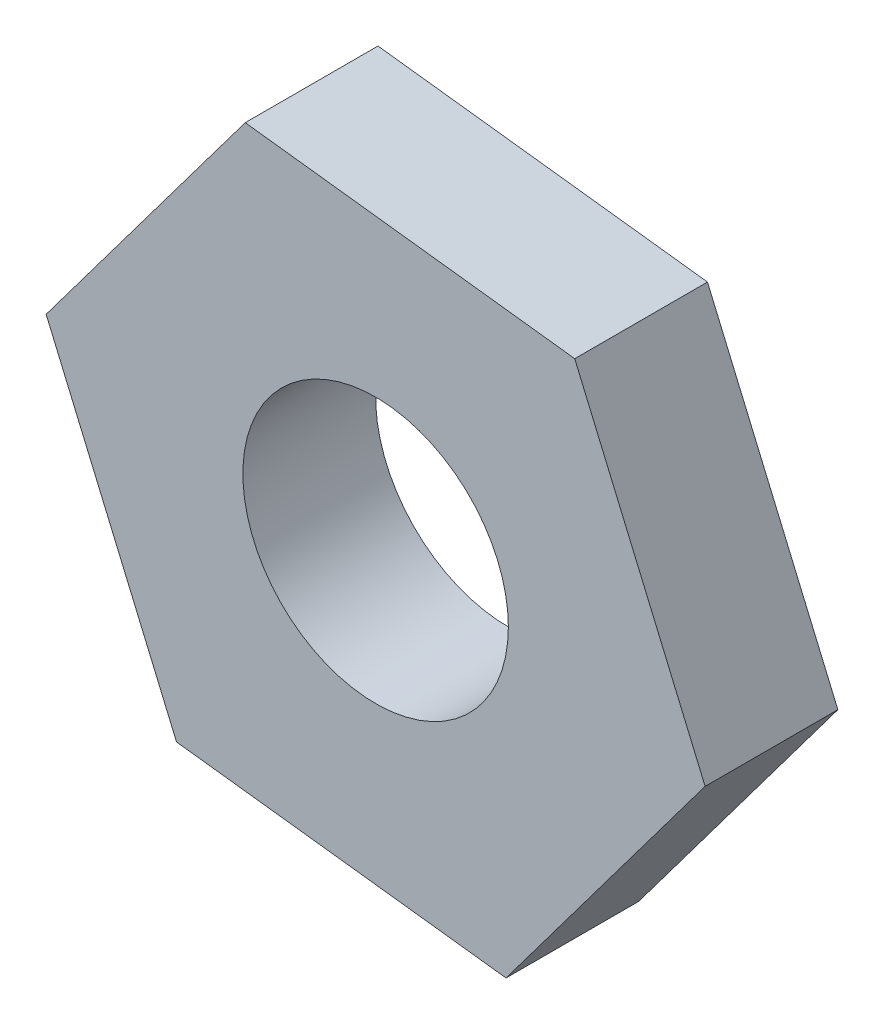
ISO-10303-21;
HEADER;
FILE_DESCRIPTION(('STEP AP214'),'2;1');
FILE_NAME('part.step','',(''),(''),'','','');
FILE_SCHEMA(('AUTOMOTIVE_DESIGN { 1 0 10303 214 1 1 1 1 }'));
ENDSEC;
DATA;
#1=APPLICATION_CONTEXT('core data for automotive mechanical design processes');
#2=APPLICATION_PROTOCOL_DEFINITION('international standard','automotive_design',2000,#1);
#3=PRODUCT_CONTEXT('',#1,'mechanical');
#4=PRODUCT('Part','Part','',(#3));
#5=PRODUCT_RELATED_PRODUCT_CATEGORY('part','',(#4));
#6=PRODUCT_DEFINITION_FORMATION('','',#4);
#7=PRODUCT_DEFINITION_CONTEXT('part definition',#1,'design');
#8=PRODUCT_DEFINITION('design','',#6,#7);
#9=PRODUCT_DEFINITION_SHAPE('','',#8);
#10=(LENGTH_UNIT() NAMED_UNIT(*) SI_UNIT(.MILLI.,.METRE.));
#11=(NAMED_UNIT(*) PLANE_ANGLE_UNIT() SI_UNIT($,.RADIAN.));
#12=(NAMED_UNIT(*) SI_UNIT($,.STERADIAN.) SOLID_ANGLE_UNIT());
#13=UNCERTAINTY_MEASURE_WITH_UNIT(LENGTH_MEASURE(1.E-05),#10,'distance_accuracy_value','');
#14=(GEOMETRIC_REPRESENTATION_CONTEXT(3) GLOBAL_UNCERTAINTY_ASSIGNED_CONTEXT((#13)) GLOBAL_UNIT_ASSIGNED_CONTEXT((#10,
#11,#12)) REPRESENTATION_CONTEXT('',''));
#15=CARTESIAN_POINT('',(0.,0.,0.));
#16=DIRECTION('',(0.,0.,1.));
#17=DIRECTION('',(1.,0.,0.));
#18=AXIS2_PLACEMENT_3D('',#15,#16,#17);
#19=CARTESIAN_POINT('',(-3.26900369872873,-5.69829824755575,4.));
#20=DIRECTION('',(-0.800051884638574,0.599930814249665,0.));
#21=DIRECTION('',(-0.599930814249665,-0.800051884638574,0.));
#22=AXIS2_PLACEMENT_3D('',#19,#20,#21);
#23=PLANE('',#22);
#24=DIRECTION('',(0.599930814249665,0.800051884638574,0.));
#25=VECTOR('',#24,1.);
#26=CARTESIAN_POINT('',(-3.26900369872873,-5.69829824755575,0.));
#27=LINE('',#26,#25);
#28=CARTESIAN_POINT('',(-3.26900369872873,-5.69829824755575,0.));
#29=VERTEX_POINT('',#28);
#30=CARTESIAN_POINT('',(2.73030444376792,2.30222059883,0.));
#31=VERTEX_POINT('',#30);
#32=EDGE_CURVE('E117',#29,#31,#27,.T.);
#33=ORIENTED_EDGE('',*,*,#32,.T.);
#34=DIRECTION('',(0.,0.,-1.));
#35=VECTOR('',#34,1.);
#36=CARTESIAN_POINT('',(2.73030444376792,2.30222059883,4.));
#37=LINE('',#36,#35);
#38=CARTESIAN_POINT('',(2.73030444376792,2.30222059883,4.));
#39=VERTEX_POINT('',#38);
#40=EDGE_CURVE('E11',#39,#31,#37,.T.);
#41=ORIENTED_EDGE('',*,*,#40,.F.);
#42=DIRECTION('',(0.599930814249665,0.800051884638574,0.));
#43=VECTOR('',#42,1.);
#44=CARTESIAN_POINT('',(-3.26900369872873,-5.69829824755575,4.));
#45=LINE('',#44,#43);
#46=CARTESIAN_POINT('',(-3.26900369872873,-5.69829824755575,4.));
#47=VERTEX_POINT('',#46);
#48=EDGE_CURVE('E128',#47,#39,#45,.T.);
#49=ORIENTED_EDGE('',*,*,#48,.F.);
#50=DIRECTION('',(0.,0.,-1.));
#51=VECTOR('',#50,1.);
#52=CARTESIAN_POINT('',(-3.26900369872873,-5.69829824755575,4.));
#53=LINE('',#52,#51);
#54=EDGE_CURVE('E113',#47,#29,#53,.T.);
#55=ORIENTED_EDGE('',*,*,#54,.T.);
#56=EDGE_LOOP('',(#33,#41,#49,#55));
#57=FACE_BOUND('',#56,.T.);
#58=ADVANCED_FACE('F33',(#57),#23,.F.);
#59=CARTESIAN_POINT('',(2.73030444376792,2.30222059883,4.));
#60=DIRECTION('',(-0.91958126797258,-0.392899849317789,0.));
#61=DIRECTION('',(0.392899849317789,-0.91958126797258,0.));
#62=AXIS2_PLACEMENT_3D('',#59,#60,#61);
#63=PLANE('',#62);
#64=DIRECTION('',(-0.392899849317789,0.91958126797258,0.));
#65=VECTOR('',#64,1.);
#66=CARTESIAN_POINT('',(2.73030444376792,2.30222059883,0.));
#67=LINE('',#66,#65);
#68=CARTESIAN_POINT('',(-1.19869404940998,11.4980332785558,0.));
#69=VERTEX_POINT('',#68);
#70=EDGE_CURVE('E120',#31,#69,#67,.T.);
#71=ORIENTED_EDGE('',*,*,#70,.T.);
#72=DIRECTION('',(0.,0.,-1.));
#73=VECTOR('',#72,1.);
#74=CARTESIAN_POINT('',(-1.19869404940998,11.4980332785558,4.));
#75=LINE('',#74,#73);
#76=CARTESIAN_POINT('',(-1.19869404940998,11.4980332785558,4.));
#77=VERTEX_POINT('',#76);
#78=EDGE_CURVE('E41',#77,#69,#75,.T.);
#79=ORIENTED_EDGE('',*,*,#78,.F.);
#80=DIRECTION('',(-0.392899849317789,0.91958126797258,0.));
#81=VECTOR('',#80,1.);
#82=CARTESIAN_POINT('',(2.73030444376792,2.30222059883,4.));
#83=LINE('',#82,#81);
#84=EDGE_CURVE('E86',#39,#77,#83,.T.);
#85=ORIENTED_EDGE('',*,*,#84,.F.);
#86=ORIENTED_EDGE('',*,*,#40,.T.);
#87=EDGE_LOOP('',(#71,#79,#85,#86));
#88=FACE_BOUND('',#87,.T.);
#89=ADVANCED_FACE('F153',(#88),#63,.F.);
#90=CARTESIAN_POINT('',(-1.19869404940998,11.4980332785558,4.));
#91=DIRECTION('',(-0.119529383334007,-0.992830663567455,0.));
#92=DIRECTION('',(0.992830663567455,-0.119529383334007,0.));
#93=AXIS2_PLACEMENT_3D('',#90,#91,#92);
#94=PLANE('',#93);
#95=DIRECTION('',(-0.992830663567455,0.119529383334007,0.));
#96=VECTOR('',#95,1.);
#97=CARTESIAN_POINT('',(-1.19869404940998,11.4980332785558,0.));
#98=LINE('',#97,#96);
#99=CARTESIAN_POINT('',(-11.1270006850845,12.6933271118959,0.));
#100=VERTEX_POINT('',#99);
#101=EDGE_CURVE('E123',#69,#100,#98,.T.);
#102=ORIENTED_EDGE('',*,*,#101,.T.);
#103=DIRECTION('',(0.,0.,-1.));
#104=VECTOR('',#103,1.);
#105=CARTESIAN_POINT('',(-11.1270006850845,12.6933271118959,4.));
#106=LINE('',#105,#104);
#107=CARTESIAN_POINT('',(-11.1270006850845,12.6933271118959,4.));
#108=VERTEX_POINT('',#107);
#109=EDGE_CURVE('E108',#108,#100,#106,.T.);
#110=ORIENTED_EDGE('',*,*,#109,.F.);
#111=DIRECTION('',(-0.992830663567455,0.119529383334007,0.));
#112=VECTOR('',#111,1.);
#113=CARTESIAN_POINT('',(-1.19869404940998,11.4980332785558,4.));
#114=LINE('',#113,#112);
#115=EDGE_CURVE('E99',#77,#108,#114,.T.);
#116=ORIENTED_EDGE('',*,*,#115,.F.);
#117=ORIENTED_EDGE('',*,*,#78,.T.);
#118=EDGE_LOOP('',(#102,#110,#116,#117));
#119=FACE_BOUND('',#118,.T.);
#120=ADVANCED_FACE('F134',(#119),#94,.F.);
#121=CARTESIAN_POINT('',(-11.1270006850845,12.6933271118959,4.));
#122=DIRECTION('',(0.800051884638574,-0.599930814249665,0.));
#123=DIRECTION('',(0.599930814249665,0.800051884638574,0.));
#124=AXIS2_PLACEMENT_3D('',#121,#122,#123);
#125=PLANE('',#124);
#126=DIRECTION('',(-0.599930814249665,-0.800051884638574,0.));
#127=VECTOR('',#126,1.);
#128=CARTESIAN_POINT('',(-11.1270006850845,12.6933271118959,0.));
#129=LINE('',#128,#127);
#130=CARTESIAN_POINT('',(-17.1263088275812,4.69280826551013,0.));
#131=VERTEX_POINT('',#130);
#132=EDGE_CURVE('E107',#100,#131,#129,.T.);
#133=ORIENTED_EDGE('',*,*,#132,.T.);
#134=DIRECTION('',(0.,0.,-1.));
#135=VECTOR('',#134,1.);
#136=CARTESIAN_POINT('',(-17.1263088275812,4.69280826551013,4.));
#137=LINE('',#136,#135);
#138=CARTESIAN_POINT('',(-17.1263088275812,4.69280826551013,4.));
#139=VERTEX_POINT('',#138);
#140=EDGE_CURVE('E104',#139,#131,#137,.T.);
#141=ORIENTED_EDGE('',*,*,#140,.F.);
#142=DIRECTION('',(-0.599930814249665,-0.800051884638574,0.));
#143=VECTOR('',#142,1.);
#144=CARTESIAN_POINT('',(-11.1270006850845,12.6933271118959,4.));
#145=LINE('',#144,#143);
#146=EDGE_CURVE('E93',#108,#139,#145,.T.);
#147=ORIENTED_EDGE('',*,*,#146,.F.);
#148=ORIENTED_EDGE('',*,*,#109,.T.);
#149=EDGE_LOOP('',(#133,#141,#147,#148));
#150=FACE_BOUND('',#149,.T.);
#151=ADVANCED_FACE('F105',(#150),#125,.F.);
#152=CARTESIAN_POINT('',(-17.1263088275812,4.69280826551013,4.));
#153=DIRECTION('',(0.91958126797258,0.392899849317789,0.));
#154=DIRECTION('',(-0.392899849317789,0.91958126797258,0.));
#155=AXIS2_PLACEMENT_3D('',#152,#153,#154);
#156=PLANE('',#155);
#157=DIRECTION('',(0.392899849317789,-0.91958126797258,0.));
#158=VECTOR('',#157,1.);
#159=CARTESIAN_POINT('',(-17.1263088275812,4.69280826551013,0.));
#160=LINE('',#159,#158);
#161=CARTESIAN_POINT('',(-13.1973103344033,-4.50300441421568,0.));
#162=VERTEX_POINT('',#161);
#163=EDGE_CURVE('E72',#131,#162,#160,.T.);
#164=ORIENTED_EDGE('',*,*,#163,.T.);
#165=DIRECTION('',(0.,0.,-1.));
#166=VECTOR('',#165,1.);
#167=CARTESIAN_POINT('',(-13.1973103344033,-4.50300441421568,4.));
#168=LINE('',#167,#166);
#169=CARTESIAN_POINT('',(-13.1973103344033,-4.50300441421568,4.));
#170=VERTEX_POINT('',#169);
#171=EDGE_CURVE('E109',#170,#162,#168,.T.);
#172=ORIENTED_EDGE('',*,*,#171,.F.);
#173=DIRECTION('',(0.392899849317789,-0.91958126797258,0.));
#174=VECTOR('',#173,1.);
#175=CARTESIAN_POINT('',(-17.1263088275812,4.69280826551013,4.));
#176=LINE('',#175,#174);
#177=EDGE_CURVE('E97',#139,#170,#176,.T.);
#178=ORIENTED_EDGE('',*,*,#177,.F.);
#179=ORIENTED_EDGE('',*,*,#140,.T.);
#180=EDGE_LOOP('',(#164,#172,#178,#179));
#181=FACE_BOUND('',#180,.T.);
#182=ADVANCED_FACE('F111',(#181),#156,.F.);
#183=CARTESIAN_POINT('',(-13.1973103344033,-4.50300441421568,4.));
#184=DIRECTION('',(0.119529383334007,0.992830663567455,0.));
#185=DIRECTION('',(-0.992830663567455,0.119529383334007,0.));
#186=AXIS2_PLACEMENT_3D('',#183,#184,#185);
#187=PLANE('',#186);
#188=DIRECTION('',(0.992830663567455,-0.119529383334007,0.));
#189=VECTOR('',#188,1.);
#190=CARTESIAN_POINT('',(-13.1973103344033,-4.50300441421568,0.));
#191=LINE('',#190,#189);
#192=EDGE_CURVE('E78',#162,#29,#191,.T.);
#193=ORIENTED_EDGE('',*,*,#192,.T.);
#194=ORIENTED_EDGE('',*,*,#54,.F.);
#195=DIRECTION('',(0.992830663567455,-0.119529383334007,0.));
#196=VECTOR('',#195,1.);
#197=CARTESIAN_POINT('',(-13.1973103344033,-4.50300441421568,4.));
#198=LINE('',#197,#196);
#199=EDGE_CURVE('E49',#170,#47,#198,.T.);
#200=ORIENTED_EDGE('',*,*,#199,.F.);
#201=ORIENTED_EDGE('',*,*,#171,.T.);
#202=EDGE_LOOP('',(#193,#194,#200,#201));
#203=FACE_BOUND('',#202,.T.);
#204=ADVANCED_FACE('F141',(#203),#187,.F.);
#205=CARTESIAN_POINT('',(0.,0.,4.));
#206=DIRECTION('',(0.,0.,1.));
#207=DIRECTION('',(1.,0.,0.));
#208=AXIS2_PLACEMENT_3D('',#205,#206,#207);
#209=PLANE('',#208);
#210=CARTESIAN_POINT('',(-7.19800219190663,3.49751443217006,4.));
#211=DIRECTION('',(0.,0.,1.));
#212=DIRECTION('',(1.,0.,0.));
#213=AXIS2_PLACEMENT_3D('',#210,#211,#212);
#214=CIRCLE('',#213,4.);
#215=CARTESIAN_POINT('',(-3.19800219190663,3.49751443217006,4.));
#216=VERTEX_POINT('',#215);
#217=EDGE_CURVE('E208',#216,#216,#214,.T.);
#218=ORIENTED_EDGE('',*,*,#217,.F.);
#219=EDGE_LOOP('',(#218));
#220=FACE_BOUND('',#219,.T.);
#221=ORIENTED_EDGE('',*,*,#48,.T.);
#222=ORIENTED_EDGE('',*,*,#84,.T.);
#223=ORIENTED_EDGE('',*,*,#115,.T.);
#224=ORIENTED_EDGE('',*,*,#146,.T.);
#225=ORIENTED_EDGE('',*,*,#177,.T.);
#226=ORIENTED_EDGE('',*,*,#199,.T.);
#227=EDGE_LOOP('',(#221,#222,#223,#224,#225,#226));
#228=FACE_BOUND('',#227,.T.);
#229=ADVANCED_FACE('F95',(#220,#228),#209,.T.);
#230=CARTESIAN_POINT('',(0.,0.,0.));
#231=DIRECTION('',(0.,0.,1.));
#232=DIRECTION('',(1.,0.,0.));
#233=AXIS2_PLACEMENT_3D('',#230,#231,#232);
#234=PLANE('',#233);
#235=CARTESIAN_POINT('',(-7.19800219190663,3.49751443217006,0.));
#236=DIRECTION('',(0.,0.,1.));
#237=DIRECTION('',(1.,0.,0.));
#238=AXIS2_PLACEMENT_3D('',#235,#236,#237);
#239=CIRCLE('',#238,4.);
#240=CARTESIAN_POINT('',(-3.19800219190663,3.49751443217006,0.));
#241=VERTEX_POINT('',#240);
#242=EDGE_CURVE('E121',#241,#241,#239,.T.);
#243=ORIENTED_EDGE('',*,*,#242,.T.);
#244=EDGE_LOOP('',(#243));
#245=FACE_BOUND('',#244,.T.);
#246=ORIENTED_EDGE('',*,*,#32,.F.);
#247=ORIENTED_EDGE('',*,*,#192,.F.);
#248=ORIENTED_EDGE('',*,*,#163,.F.);
#249=ORIENTED_EDGE('',*,*,#132,.F.);
#250=ORIENTED_EDGE('',*,*,#101,.F.);
#251=ORIENTED_EDGE('',*,*,#70,.F.);
#252=EDGE_LOOP('',(#246,#247,#248,#249,#250,#251));
#253=FACE_BOUND('',#252,.T.);
#254=ADVANCED_FACE('F137',(#245,#253),#234,.F.);
#255=CARTESIAN_POINT('',(-7.19800219190663,3.49751443217006,0.));
#256=DIRECTION('',(0.,0.,1.));
#257=DIRECTION('',(1.,0.,0.));
#258=AXIS2_PLACEMENT_3D('',#255,#256,#257);
#259=CYLINDRICAL_SURFACE('',#258,4.);
#260=ORIENTED_EDGE('',*,*,#242,.F.);
#261=EDGE_LOOP('',(#260));
#262=FACE_BOUND('',#261,.T.);
#263=ORIENTED_EDGE('',*,*,#217,.T.);
#264=EDGE_LOOP('',(#263));
#265=FACE_BOUND('',#264,.T.);
#266=ADVANCED_FACE('F190',(#262,#265),#259,.F.);
#267=CLOSED_SHELL('',(#58,#89,#120,#151,#182,#204,#229,#254,#266));
#268=MANIFOLD_SOLID_BREP('B2',#267);
#269=ADVANCED_BREP_SHAPE_REPRESENTATION('',(#18,#268),#14);
#270=SHAPE_DEFINITION_REPRESENTATION(#9,#269);
ENDSEC;
END-ISO-10303-21;
